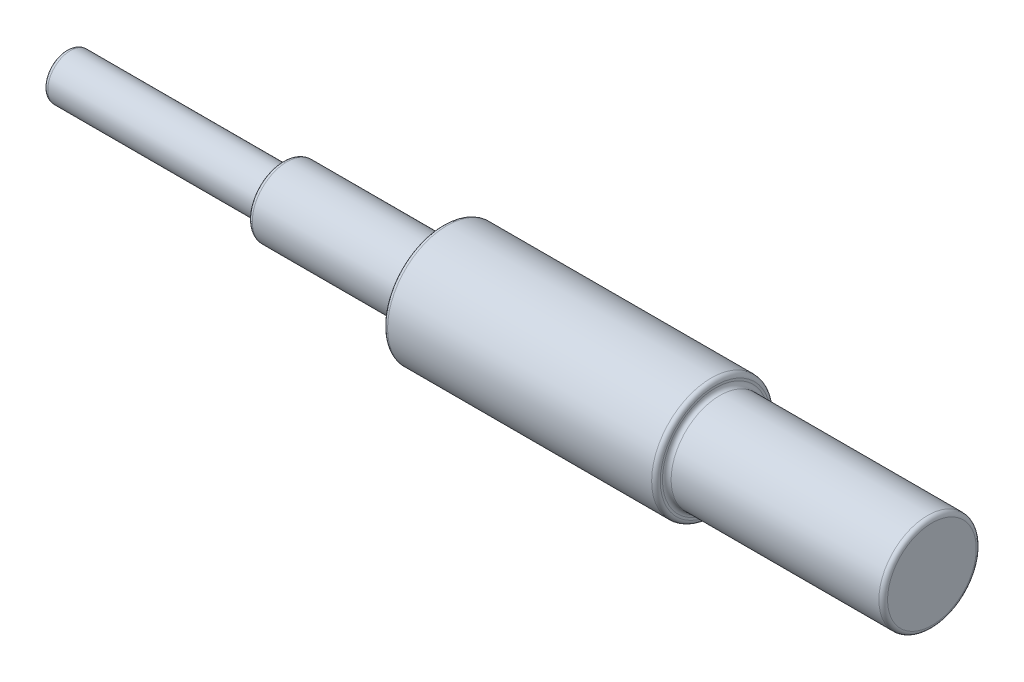
ISO-10303-21;
HEADER;
FILE_DESCRIPTION(('STEP AP214'),'2;1');
FILE_NAME('part.step','',(''),(''),'','','');
FILE_SCHEMA(('AUTOMOTIVE_DESIGN { 1 0 10303 214 1 1 1 1 }'));
ENDSEC;
DATA;
#1=APPLICATION_CONTEXT('core data for automotive mechanical design processes');
#2=APPLICATION_PROTOCOL_DEFINITION('international standard','automotive_design',2000,#1);
#3=PRODUCT_CONTEXT('',#1,'mechanical');
#4=PRODUCT('Part','Part','',(#3));
#5=PRODUCT_RELATED_PRODUCT_CATEGORY('part','',(#4));
#6=PRODUCT_DEFINITION_FORMATION('','',#4);
#7=PRODUCT_DEFINITION_CONTEXT('part definition',#1,'design');
#8=PRODUCT_DEFINITION('design','',#6,#7);
#9=PRODUCT_DEFINITION_SHAPE('','',#8);
#10=(LENGTH_UNIT() NAMED_UNIT(*) SI_UNIT(.MILLI.,.METRE.));
#11=(NAMED_UNIT(*) PLANE_ANGLE_UNIT() SI_UNIT($,.RADIAN.));
#12=(NAMED_UNIT(*) SI_UNIT($,.STERADIAN.) SOLID_ANGLE_UNIT());
#13=UNCERTAINTY_MEASURE_WITH_UNIT(LENGTH_MEASURE(1.E-05),#10,'distance_accuracy_value','');
#14=(GEOMETRIC_REPRESENTATION_CONTEXT(3) GLOBAL_UNCERTAINTY_ASSIGNED_CONTEXT((#13)) GLOBAL_UNIT_ASSIGNED_CONTEXT((#10,
#11,#12)) REPRESENTATION_CONTEXT('',''));
#15=CARTESIAN_POINT('',(0.,0.,0.));
#16=DIRECTION('',(0.,0.,1.));
#17=DIRECTION('',(1.,0.,0.));
#18=AXIS2_PLACEMENT_3D('',#15,#16,#17);
#19=CARTESIAN_POINT('',(400.,0.,0.));
#20=DIRECTION('',(-1.,0.,0.));
#21=DIRECTION('',(0.,0.,1.));
#22=AXIS2_PLACEMENT_3D('',#19,#20,#21);
#23=PLANE('',#22);
#24=CARTESIAN_POINT('',(400.,0.,0.));
#25=DIRECTION('',(-1.,0.,0.));
#26=DIRECTION('',(0.,0.,1.));
#27=AXIS2_PLACEMENT_3D('',#24,#25,#26);
#28=CIRCLE('',#27,20.5);
#29=CARTESIAN_POINT('',(400.,0.,20.5));
#30=VERTEX_POINT('',#29);
#31=EDGE_CURVE('E84',#30,#30,#28,.F.);
#32=ORIENTED_EDGE('',*,*,#31,.T.);
#33=EDGE_LOOP('',(#32));
#34=FACE_BOUND('',#33,.T.);
#35=ADVANCED_FACE('F43',(#34),#23,.F.);
#36=CARTESIAN_POINT('',(0.,0.,0.));
#37=DIRECTION('',(-1.,0.,0.));
#38=DIRECTION('',(0.,0.,1.));
#39=AXIS2_PLACEMENT_3D('',#36,#37,#38);
#40=CYLINDRICAL_SURFACE('',#39,22.5);
#41=CARTESIAN_POINT('',(398.,0.,0.));
#42=DIRECTION('',(-1.,0.,0.));
#43=DIRECTION('',(0.,0.,1.));
#44=AXIS2_PLACEMENT_3D('',#41,#42,#43);
#45=CIRCLE('',#44,22.5);
#46=CARTESIAN_POINT('',(398.,0.,22.5));
#47=VERTEX_POINT('',#46);
#48=EDGE_CURVE('E87',#47,#47,#45,.T.);
#49=ORIENTED_EDGE('',*,*,#48,.T.);
#50=EDGE_LOOP('',(#49));
#51=FACE_BOUND('',#50,.T.);
#52=CARTESIAN_POINT('',(302.,0.,0.));
#53=DIRECTION('',(-1.,0.,0.));
#54=DIRECTION('',(0.,0.,1.));
#55=AXIS2_PLACEMENT_3D('',#52,#53,#54);
#56=CIRCLE('',#55,22.5);
#57=CARTESIAN_POINT('',(302.,0.,22.5));
#58=VERTEX_POINT('',#57);
#59=EDGE_CURVE('E90',#58,#58,#56,.F.);
#60=ORIENTED_EDGE('',*,*,#59,.T.);
#61=EDGE_LOOP('',(#60));
#62=FACE_BOUND('',#61,.T.);
#63=ADVANCED_FACE('F119',(#51,#62),#40,.T.);
#64=CARTESIAN_POINT('',(300.,0.,-27.5));
#65=DIRECTION('',(-1.,0.,0.));
#66=DIRECTION('',(0.,0.,1.));
#67=AXIS2_PLACEMENT_3D('',#64,#65,#66);
#68=PLANE('',#67);
#69=CARTESIAN_POINT('',(300.,0.,0.));
#70=DIRECTION('',(-1.,0.,0.));
#71=DIRECTION('',(0.,0.,1.));
#72=AXIS2_PLACEMENT_3D('',#69,#70,#71);
#73=CIRCLE('',#72,24.5);
#74=CARTESIAN_POINT('',(300.,0.,24.5));
#75=VERTEX_POINT('',#74);
#76=EDGE_CURVE('E78',#75,#75,#73,.T.);
#77=ORIENTED_EDGE('',*,*,#76,.T.);
#78=EDGE_LOOP('',(#77));
#79=FACE_BOUND('',#78,.T.);
#80=CARTESIAN_POINT('',(300.,0.,0.));
#81=DIRECTION('',(-1.,0.,0.));
#82=DIRECTION('',(0.,0.,1.));
#83=AXIS2_PLACEMENT_3D('',#80,#81,#82);
#84=CIRCLE('',#83,25.5);
#85=CARTESIAN_POINT('',(300.,0.,25.5));
#86=VERTEX_POINT('',#85);
#87=EDGE_CURVE('E81',#86,#86,#84,.F.);
#88=ORIENTED_EDGE('',*,*,#87,.T.);
#89=EDGE_LOOP('',(#88));
#90=FACE_BOUND('',#89,.T.);
#91=ADVANCED_FACE('F124',(#79,#90),#68,.F.);
#92=CARTESIAN_POINT('',(0.,0.,0.));
#93=DIRECTION('',(-1.,0.,0.));
#94=DIRECTION('',(0.,0.,1.));
#95=AXIS2_PLACEMENT_3D('',#92,#93,#94);
#96=CYLINDRICAL_SURFACE('',#95,27.5);
#97=CARTESIAN_POINT('',(298.,0.,0.));
#98=DIRECTION('',(-1.,0.,0.));
#99=DIRECTION('',(0.,0.,1.));
#100=AXIS2_PLACEMENT_3D('',#97,#98,#99);
#101=CIRCLE('',#100,27.5);
#102=CARTESIAN_POINT('',(298.,0.,27.5));
#103=VERTEX_POINT('',#102);
#104=EDGE_CURVE('E72',#103,#103,#101,.T.);
#105=ORIENTED_EDGE('',*,*,#104,.T.);
#106=EDGE_LOOP('',(#105));
#107=FACE_BOUND('',#106,.T.);
#108=CARTESIAN_POINT('',(175.994186744595,0.,0.));
#109=DIRECTION('',(1.,0.,0.));
#110=DIRECTION('',(0.,0.,-1.));
#111=AXIS2_PLACEMENT_3D('',#108,#109,#110);
#112=CIRCLE('',#111,27.5);
#113=CARTESIAN_POINT('',(175.994186744595,0.,-27.5));
#114=VERTEX_POINT('',#113);
#115=EDGE_CURVE('E75',#114,#114,#112,.T.);
#116=ORIENTED_EDGE('',*,*,#115,.T.);
#117=EDGE_LOOP('',(#116));
#118=FACE_BOUND('',#117,.T.);
#119=ADVANCED_FACE('F130',(#107,#118),#96,.T.);
#120=CARTESIAN_POINT('',(173.994186744595,0.,-27.5));
#121=DIRECTION('',(1.,0.,0.));
#122=DIRECTION('',(0.,0.,-1.));
#123=AXIS2_PLACEMENT_3D('',#120,#121,#122);
#124=PLANE('',#123);
#125=CARTESIAN_POINT('',(173.994186744595,0.,0.));
#126=DIRECTION('',(1.,0.,0.));
#127=DIRECTION('',(0.,0.,-1.));
#128=AXIS2_PLACEMENT_3D('',#125,#126,#127);
#129=CIRCLE('',#128,25.5);
#130=CARTESIAN_POINT('',(173.994186744595,0.,-25.5));
#131=VERTEX_POINT('',#130);
#132=EDGE_CURVE('E66',#131,#131,#129,.F.);
#133=ORIENTED_EDGE('',*,*,#132,.T.);
#134=EDGE_LOOP('',(#133));
#135=FACE_BOUND('',#134,.T.);
#136=CARTESIAN_POINT('',(173.994186744595,0.,0.));
#137=DIRECTION('',(1.,0.,0.));
#138=DIRECTION('',(0.,0.,-1.));
#139=AXIS2_PLACEMENT_3D('',#136,#137,#138);
#140=CIRCLE('',#139,18.);
#141=CARTESIAN_POINT('',(173.994186744595,0.,-18.));
#142=VERTEX_POINT('',#141);
#143=EDGE_CURVE('E69',#142,#142,#140,.T.);
#144=ORIENTED_EDGE('',*,*,#143,.T.);
#145=EDGE_LOOP('',(#144));
#146=FACE_BOUND('',#145,.T.);
#147=ADVANCED_FACE('F134',(#135,#146),#124,.F.);
#148=CARTESIAN_POINT('',(0.,0.,0.));
#149=DIRECTION('',(-1.,0.,0.));
#150=DIRECTION('',(0.,0.,1.));
#151=AXIS2_PLACEMENT_3D('',#148,#149,#150);
#152=CYLINDRICAL_SURFACE('',#151,16.);
#153=CARTESIAN_POINT('',(171.994186744595,0.,0.));
#154=DIRECTION('',(1.,0.,0.));
#155=DIRECTION('',(0.,0.,-1.));
#156=AXIS2_PLACEMENT_3D('',#153,#154,#155);
#157=CIRCLE('',#156,16.);
#158=CARTESIAN_POINT('',(171.994186744595,0.,-16.));
#159=VERTEX_POINT('',#158);
#160=EDGE_CURVE('E58',#159,#159,#157,.F.);
#161=ORIENTED_EDGE('',*,*,#160,.T.);
#162=EDGE_LOOP('',(#161));
#163=FACE_BOUND('',#162,.T.);
#164=CARTESIAN_POINT('',(102.,0.,0.));
#165=DIRECTION('',(1.,0.,0.));
#166=DIRECTION('',(0.,0.,-1.));
#167=AXIS2_PLACEMENT_3D('',#164,#165,#166);
#168=CIRCLE('',#167,16.);
#169=CARTESIAN_POINT('',(102.,0.,-16.));
#170=VERTEX_POINT('',#169);
#171=EDGE_CURVE('E63',#170,#170,#168,.T.);
#172=ORIENTED_EDGE('',*,*,#171,.T.);
#173=EDGE_LOOP('',(#172));
#174=FACE_BOUND('',#173,.T.);
#175=ADVANCED_FACE('F138',(#163,#174),#152,.T.);
#176=CARTESIAN_POINT('',(100.,0.,-10.5));
#177=DIRECTION('',(1.,0.,0.));
#178=DIRECTION('',(0.,0.,-1.));
#179=AXIS2_PLACEMENT_3D('',#176,#177,#178);
#180=PLANE('',#179);
#181=CARTESIAN_POINT('',(100.,0.,0.));
#182=DIRECTION('',(1.,0.,0.));
#183=DIRECTION('',(0.,0.,-1.));
#184=AXIS2_PLACEMENT_3D('',#181,#182,#183);
#185=CIRCLE('',#184,14.);
#186=CARTESIAN_POINT('',(100.,0.,-14.));
#187=VERTEX_POINT('',#186);
#188=EDGE_CURVE('E50',#187,#187,#185,.F.);
#189=ORIENTED_EDGE('',*,*,#188,.T.);
#190=EDGE_LOOP('',(#189));
#191=FACE_BOUND('',#190,.T.);
#192=CARTESIAN_POINT('',(100.,0.,0.));
#193=DIRECTION('',(1.,0.,0.));
#194=DIRECTION('',(0.,0.,-1.));
#195=AXIS2_PLACEMENT_3D('',#192,#193,#194);
#196=CIRCLE('',#195,12.5);
#197=CARTESIAN_POINT('',(100.,0.,-12.5));
#198=VERTEX_POINT('',#197);
#199=EDGE_CURVE('E54',#198,#198,#196,.T.);
#200=ORIENTED_EDGE('',*,*,#199,.T.);
#201=EDGE_LOOP('',(#200));
#202=FACE_BOUND('',#201,.T.);
#203=ADVANCED_FACE('F142',(#191,#202),#180,.F.);
#204=CARTESIAN_POINT('',(0.,0.,0.));
#205=DIRECTION('',(-1.,0.,0.));
#206=DIRECTION('',(0.,0.,1.));
#207=AXIS2_PLACEMENT_3D('',#204,#205,#206);
#208=CYLINDRICAL_SURFACE('',#207,10.5);
#209=CARTESIAN_POINT('',(98.,0.,0.));
#210=DIRECTION('',(1.,0.,0.));
#211=DIRECTION('',(0.,0.,-1.));
#212=AXIS2_PLACEMENT_3D('',#209,#210,#211);
#213=CIRCLE('',#212,10.5);
#214=CARTESIAN_POINT('',(98.,0.,-10.5));
#215=VERTEX_POINT('',#214);
#216=EDGE_CURVE('E10',#215,#215,#213,.F.);
#217=ORIENTED_EDGE('',*,*,#216,.T.);
#218=EDGE_LOOP('',(#217));
#219=FACE_BOUND('',#218,.T.);
#220=CARTESIAN_POINT('',(2.,0.,0.));
#221=DIRECTION('',(1.,0.,0.));
#222=DIRECTION('',(0.,0.,-1.));
#223=AXIS2_PLACEMENT_3D('',#220,#221,#222);
#224=CIRCLE('',#223,10.5);
#225=CARTESIAN_POINT('',(2.,0.,-10.5));
#226=VERTEX_POINT('',#225);
#227=EDGE_CURVE('E93',#226,#226,#224,.T.);
#228=ORIENTED_EDGE('',*,*,#227,.T.);
#229=EDGE_LOOP('',(#228));
#230=FACE_BOUND('',#229,.T.);
#231=ADVANCED_FACE('F114',(#219,#230),#208,.T.);
#232=CARTESIAN_POINT('',(0.,0.,0.));
#233=DIRECTION('',(1.,0.,0.));
#234=DIRECTION('',(0.,0.,-1.));
#235=AXIS2_PLACEMENT_3D('',#232,#233,#234);
#236=PLANE('',#235);
#237=CARTESIAN_POINT('',(0.,0.,0.));
#238=DIRECTION('',(1.,0.,0.));
#239=DIRECTION('',(0.,0.,-1.));
#240=AXIS2_PLACEMENT_3D('',#237,#238,#239);
#241=CIRCLE('',#240,8.5);
#242=CARTESIAN_POINT('',(0.,0.,-8.5));
#243=VERTEX_POINT('',#242);
#244=EDGE_CURVE('E96',#243,#243,#241,.F.);
#245=ORIENTED_EDGE('',*,*,#244,.T.);
#246=EDGE_LOOP('',(#245));
#247=FACE_BOUND('',#246,.T.);
#248=ADVANCED_FACE('F100',(#247),#236,.F.);
#249=CARTESIAN_POINT('',(2.,0.,0.));
#250=DIRECTION('',(1.,0.,0.));
#251=DIRECTION('',(0.,0.,-1.));
#252=AXIS2_PLACEMENT_3D('',#249,#250,#251);
#253=TOROIDAL_SURFACE('',#252,8.5,2.);
#254=ORIENTED_EDGE('',*,*,#227,.F.);
#255=EDGE_LOOP('',(#254));
#256=FACE_BOUND('',#255,.T.);
#257=ORIENTED_EDGE('',*,*,#244,.F.);
#258=EDGE_LOOP('',(#257));
#259=FACE_BOUND('',#258,.T.);
#260=ADVANCED_FACE('F102',(#256,#259),#253,.T.);
#261=CARTESIAN_POINT('',(398.,0.,0.));
#262=DIRECTION('',(-1.,0.,0.));
#263=DIRECTION('',(0.,0.,1.));
#264=AXIS2_PLACEMENT_3D('',#261,#262,#263);
#265=TOROIDAL_SURFACE('',#264,20.5,2.);
#266=ORIENTED_EDGE('',*,*,#31,.F.);
#267=EDGE_LOOP('',(#266));
#268=FACE_BOUND('',#267,.T.);
#269=ORIENTED_EDGE('',*,*,#48,.F.);
#270=EDGE_LOOP('',(#269));
#271=FACE_BOUND('',#270,.T.);
#272=ADVANCED_FACE('F104',(#268,#271),#265,.T.);
#273=CARTESIAN_POINT('',(302.,0.,0.));
#274=DIRECTION('',(-1.,0.,0.));
#275=DIRECTION('',(0.,0.,1.));
#276=AXIS2_PLACEMENT_3D('',#273,#274,#275);
#277=TOROIDAL_SURFACE('',#276,24.5,2.);
#278=ORIENTED_EDGE('',*,*,#59,.F.);
#279=EDGE_LOOP('',(#278));
#280=FACE_BOUND('',#279,.T.);
#281=ORIENTED_EDGE('',*,*,#76,.F.);
#282=EDGE_LOOP('',(#281));
#283=FACE_BOUND('',#282,.T.);
#284=ADVANCED_FACE('F111',(#280,#283),#277,.F.);
#285=CARTESIAN_POINT('',(298.,0.,0.));
#286=DIRECTION('',(-1.,0.,0.));
#287=DIRECTION('',(0.,0.,1.));
#288=AXIS2_PLACEMENT_3D('',#285,#286,#287);
#289=TOROIDAL_SURFACE('',#288,25.5,2.);
#290=ORIENTED_EDGE('',*,*,#87,.F.);
#291=EDGE_LOOP('',(#290));
#292=FACE_BOUND('',#291,.T.);
#293=ORIENTED_EDGE('',*,*,#104,.F.);
#294=EDGE_LOOP('',(#293));
#295=FACE_BOUND('',#294,.T.);
#296=ADVANCED_FACE('F226',(#292,#295),#289,.T.);
#297=CARTESIAN_POINT('',(175.994186744595,0.,0.));
#298=DIRECTION('',(1.,0.,0.));
#299=DIRECTION('',(0.,0.,-1.));
#300=AXIS2_PLACEMENT_3D('',#297,#298,#299);
#301=TOROIDAL_SURFACE('',#300,25.5,2.);
#302=ORIENTED_EDGE('',*,*,#115,.F.);
#303=EDGE_LOOP('',(#302));
#304=FACE_BOUND('',#303,.T.);
#305=ORIENTED_EDGE('',*,*,#132,.F.);
#306=EDGE_LOOP('',(#305));
#307=FACE_BOUND('',#306,.T.);
#308=ADVANCED_FACE('F237',(#304,#307),#301,.T.);
#309=CARTESIAN_POINT('',(171.994186744595,0.,0.));
#310=DIRECTION('',(1.,0.,0.));
#311=DIRECTION('',(0.,0.,-1.));
#312=AXIS2_PLACEMENT_3D('',#309,#310,#311);
#313=TOROIDAL_SURFACE('',#312,18.,2.);
#314=ORIENTED_EDGE('',*,*,#143,.F.);
#315=EDGE_LOOP('',(#314));
#316=FACE_BOUND('',#315,.T.);
#317=ORIENTED_EDGE('',*,*,#160,.F.);
#318=EDGE_LOOP('',(#317));
#319=FACE_BOUND('',#318,.T.);
#320=ADVANCED_FACE('F247',(#316,#319),#313,.F.);
#321=CARTESIAN_POINT('',(102.,0.,0.));
#322=DIRECTION('',(1.,0.,0.));
#323=DIRECTION('',(0.,0.,-1.));
#324=AXIS2_PLACEMENT_3D('',#321,#322,#323);
#325=TOROIDAL_SURFACE('',#324,14.,2.);
#326=ORIENTED_EDGE('',*,*,#171,.F.);
#327=EDGE_LOOP('',(#326));
#328=FACE_BOUND('',#327,.T.);
#329=ORIENTED_EDGE('',*,*,#188,.F.);
#330=EDGE_LOOP('',(#329));
#331=FACE_BOUND('',#330,.T.);
#332=ADVANCED_FACE('F257',(#328,#331),#325,.T.);
#333=CARTESIAN_POINT('',(98.,0.,0.));
#334=DIRECTION('',(1.,0.,0.));
#335=DIRECTION('',(0.,0.,-1.));
#336=AXIS2_PLACEMENT_3D('',#333,#334,#335);
#337=TOROIDAL_SURFACE('',#336,12.5,2.);
#338=ORIENTED_EDGE('',*,*,#199,.F.);
#339=EDGE_LOOP('',(#338));
#340=FACE_BOUND('',#339,.T.);
#341=ORIENTED_EDGE('',*,*,#216,.F.);
#342=EDGE_LOOP('',(#341));
#343=FACE_BOUND('',#342,.T.);
#344=ADVANCED_FACE('F45',(#340,#343),#337,.F.);
#345=CLOSED_SHELL('',(#35,#63,#91,#119,#147,#175,#203,#231,#248,#260,#272,#284,#296,#308,#320,
#332,#344));
#346=MANIFOLD_SOLID_BREP('B2',#345);
#347=ADVANCED_BREP_SHAPE_REPRESENTATION('',(#18,#346),#14);
#348=SHAPE_DEFINITION_REPRESENTATION(#9,#347);
ENDSEC;
END-ISO-10303-21;
